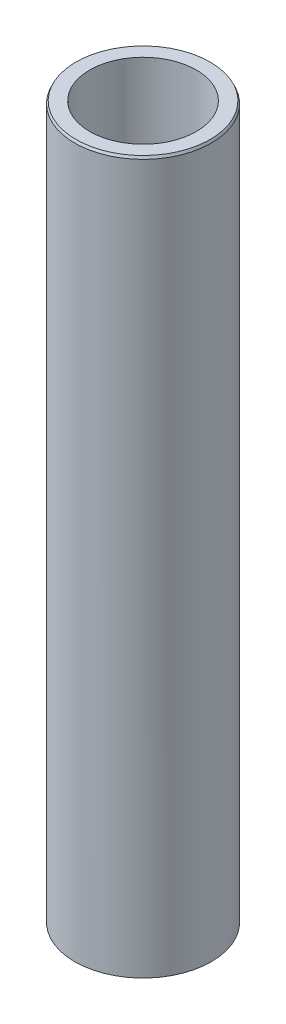
ISO-10303-21;
HEADER;
FILE_DESCRIPTION(('STEP AP214'),'2;1');
FILE_NAME('part.step','',(''),(''),'','','');
FILE_SCHEMA(('AUTOMOTIVE_DESIGN { 1 0 10303 214 1 1 1 1 }'));
ENDSEC;
DATA;
#1=APPLICATION_CONTEXT('core data for automotive mechanical design processes');
#2=APPLICATION_PROTOCOL_DEFINITION('international standard','automotive_design',2000,#1);
#3=PRODUCT_CONTEXT('',#1,'mechanical');
#4=PRODUCT('Part','Part','',(#3));
#5=PRODUCT_RELATED_PRODUCT_CATEGORY('part','',(#4));
#6=PRODUCT_DEFINITION_FORMATION('','',#4);
#7=PRODUCT_DEFINITION_CONTEXT('part definition',#1,'design');
#8=PRODUCT_DEFINITION('design','',#6,#7);
#9=PRODUCT_DEFINITION_SHAPE('','',#8);
#10=(LENGTH_UNIT() NAMED_UNIT(*) SI_UNIT(.MILLI.,.METRE.));
#11=(NAMED_UNIT(*) PLANE_ANGLE_UNIT() SI_UNIT($,.RADIAN.));
#12=(NAMED_UNIT(*) SI_UNIT($,.STERADIAN.) SOLID_ANGLE_UNIT());
#13=UNCERTAINTY_MEASURE_WITH_UNIT(LENGTH_MEASURE(1.E-05),#10,'distance_accuracy_value','');
#14=(GEOMETRIC_REPRESENTATION_CONTEXT(3) GLOBAL_UNCERTAINTY_ASSIGNED_CONTEXT((#13)) GLOBAL_UNIT_ASSIGNED_CONTEXT((#10,
#11,#12)) REPRESENTATION_CONTEXT('',''));
#15=CARTESIAN_POINT('',(0.,0.,0.));
#16=DIRECTION('',(0.,0.,1.));
#17=DIRECTION('',(1.,0.,0.));
#18=AXIS2_PLACEMENT_3D('',#15,#16,#17);
#19=CARTESIAN_POINT('',(0.,600.,0.));
#20=DIRECTION('',(0.,-1.,0.));
#21=DIRECTION('',(0.,0.,-1.));
#22=AXIS2_PLACEMENT_3D('',#19,#20,#21);
#23=CYLINDRICAL_SURFACE('',#22,57.5);
#24=CARTESIAN_POINT('',(0.,597.866919430286,0.));
#25=DIRECTION('',(0.,1.,0.));
#26=DIRECTION('',(0.,0.,1.));
#27=AXIS2_PLACEMENT_3D('',#24,#25,#26);
#28=CIRCLE('',#27,57.5);
#29=CARTESIAN_POINT('',(0.,597.866919430286,-57.5));
#30=VERTEX_POINT('',#29);
#31=EDGE_CURVE('E50',#30,#30,#28,.F.);
#32=ORIENTED_EDGE('',*,*,#31,.T.);
#33=EDGE_LOOP('',(#32));
#34=FACE_BOUND('',#33,.T.);
#35=CARTESIAN_POINT('',(0.,1.0017124247077,0.));
#36=DIRECTION('',(0.,1.,0.));
#37=DIRECTION('',(0.,0.,1.));
#38=AXIS2_PLACEMENT_3D('',#35,#36,#37);
#39=CIRCLE('',#38,57.5);
#40=CARTESIAN_POINT('',(0.,1.0017124247077,57.5));
#41=VERTEX_POINT('',#40);
#42=EDGE_CURVE('E51',#41,#41,#39,.T.);
#43=ORIENTED_EDGE('',*,*,#42,.T.);
#44=EDGE_LOOP('',(#43));
#45=FACE_BOUND('',#44,.T.);
#46=ADVANCED_FACE('F39',(#34,#45),#23,.T.);
#47=CARTESIAN_POINT('',(0.,600.,0.));
#48=DIRECTION('',(0.,1.,0.));
#49=DIRECTION('',(0.,0.,1.));
#50=AXIS2_PLACEMENT_3D('',#47,#48,#49);
#51=PLANE('',#50);
#52=CARTESIAN_POINT('',(0.,600.,0.));
#53=DIRECTION('',(0.,1.,0.));
#54=DIRECTION('',(0.,0.,1.));
#55=AXIS2_PLACEMENT_3D('',#52,#53,#54);
#56=CIRCLE('',#55,56.4982875752921);
#57=CARTESIAN_POINT('',(0.,600.,-56.4982875752921));
#58=VERTEX_POINT('',#57);
#59=EDGE_CURVE('E54',#58,#58,#56,.T.);
#60=ORIENTED_EDGE('',*,*,#59,.T.);
#61=EDGE_LOOP('',(#60));
#62=FACE_BOUND('',#61,.T.);
#63=CARTESIAN_POINT('',(0.,600.,0.));
#64=DIRECTION('',(0.,1.,0.));
#65=DIRECTION('',(0.,0.,1.));
#66=AXIS2_PLACEMENT_3D('',#63,#64,#65);
#67=CIRCLE('',#66,44.8925300068392);
#68=CARTESIAN_POINT('',(0.,600.,44.8925300068392));
#69=VERTEX_POINT('',#68);
#70=EDGE_CURVE('E58',#69,#69,#67,.T.);
#71=ORIENTED_EDGE('',*,*,#70,.F.);
#72=EDGE_LOOP('',(#71));
#73=FACE_BOUND('',#72,.T.);
#74=ADVANCED_FACE('F69',(#62,#73),#51,.T.);
#75=CARTESIAN_POINT('',(0.,0.,0.));
#76=DIRECTION('',(0.,1.,0.));
#77=DIRECTION('',(0.,0.,1.));
#78=AXIS2_PLACEMENT_3D('',#75,#76,#77);
#79=PLANE('',#78);
#80=CARTESIAN_POINT('',(0.,0.,0.));
#81=DIRECTION('',(0.,1.,0.));
#82=DIRECTION('',(0.,0.,1.));
#83=AXIS2_PLACEMENT_3D('',#80,#81,#82);
#84=CIRCLE('',#83,55.3669194302867);
#85=CARTESIAN_POINT('',(0.,0.,55.3669194302867));
#86=VERTEX_POINT('',#85);
#87=EDGE_CURVE('E10',#86,#86,#84,.F.);
#88=ORIENTED_EDGE('',*,*,#87,.T.);
#89=EDGE_LOOP('',(#88));
#90=FACE_BOUND('',#89,.T.);
#91=CARTESIAN_POINT('',(0.,0.,0.));
#92=DIRECTION('',(0.,1.,0.));
#93=DIRECTION('',(0.,0.,1.));
#94=AXIS2_PLACEMENT_3D('',#91,#92,#93);
#95=CIRCLE('',#94,44.8925300068392);
#96=CARTESIAN_POINT('',(0.,0.,44.8925300068392));
#97=VERTEX_POINT('',#96);
#98=EDGE_CURVE('E63',#97,#97,#95,.T.);
#99=ORIENTED_EDGE('',*,*,#98,.T.);
#100=EDGE_LOOP('',(#99));
#101=FACE_BOUND('',#100,.T.);
#102=ADVANCED_FACE('F75',(#90,#101),#79,.F.);
#103=CARTESIAN_POINT('',(0.,600.,0.));
#104=DIRECTION('',(0.,-1.,0.));
#105=DIRECTION('',(0.,0.,-1.));
#106=AXIS2_PLACEMENT_3D('',#103,#104,#105);
#107=CYLINDRICAL_SURFACE('',#106,44.8925300068392);
#108=ORIENTED_EDGE('',*,*,#70,.T.);
#109=EDGE_LOOP('',(#108));
#110=FACE_BOUND('',#109,.T.);
#111=ORIENTED_EDGE('',*,*,#98,.F.);
#112=EDGE_LOOP('',(#111));
#113=FACE_BOUND('',#112,.T.);
#114=ADVANCED_FACE('F70',(#110,#113),#107,.F.);
#115=CARTESIAN_POINT('',(0.,600.,0.));
#116=DIRECTION('',(0.,-1.,0.));
#117=DIRECTION('',(0.,0.,-1.));
#118=AXIS2_PLACEMENT_3D('',#115,#116,#117);
#119=CONICAL_SURFACE('',#118,56.4982875752921,0.439040042509393);
#120=CARTESIAN_POINT('',(0.,597.866919430286,-57.5));
#121=CARTESIAN_POINT('',(0.,597.889139019554,-57.489565495576));
#122=CARTESIAN_POINT('',(0.,597.911358608822,-57.479130991152));
#123=CARTESIAN_POINT('',(0.,597.955797787358,-57.4582619823039));
#124=CARTESIAN_POINT('',(0.,597.978017376626,-57.4478274778798));
#125=CARTESIAN_POINT('',(0.,598.022456555161,-57.4269584690317));
#126=CARTESIAN_POINT('',(0.,598.044676144429,-57.4165239646077));
#127=CARTESIAN_POINT('',(0.,598.089115322965,-57.3956549557596));
#128=CARTESIAN_POINT('',(0.,598.111334912233,-57.3852204513356));
#129=CARTESIAN_POINT('',(0.,598.155774090768,-57.3643514424875));
#130=CARTESIAN_POINT('',(0.,598.177993680036,-57.3539169380634));
#131=CARTESIAN_POINT('',(0.,598.222432858572,-57.3330479292154));
#132=CARTESIAN_POINT('',(0.,598.24465244784,-57.3226134247913));
#133=CARTESIAN_POINT('',(0.,598.289091626375,-57.3017444159432));
#134=CARTESIAN_POINT('',(0.,598.311311215643,-57.2913099115192));
#135=CARTESIAN_POINT('',(0.,598.355750394179,-57.2704409026711));
#136=CARTESIAN_POINT('',(0.,598.377969983447,-57.2600063982471));
#137=CARTESIAN_POINT('',(0.,598.422409161983,-57.239137389399));
#138=CARTESIAN_POINT('',(0.,598.44462875125,-57.228702884975));
#139=CARTESIAN_POINT('',(0.,598.489067929786,-57.2078338761269));
#140=CARTESIAN_POINT('',(0.,598.511287519054,-57.1973993717028));
#141=CARTESIAN_POINT('',(0.,598.55572669759,-57.1765303628547));
#142=CARTESIAN_POINT('',(0.,598.577946286858,-57.1660958584307));
#143=CARTESIAN_POINT('',(0.,598.622385465393,-57.1452268495826));
#144=CARTESIAN_POINT('',(0.,598.644605054661,-57.1347923451586));
#145=CARTESIAN_POINT('',(0.,598.689044233197,-57.1139233363105));
#146=CARTESIAN_POINT('',(0.,598.711263822465,-57.1034888318865));
#147=CARTESIAN_POINT('',(0.,598.755703001,-57.0826198230384));
#148=CARTESIAN_POINT('',(0.,598.777922590268,-57.0721853186143));
#149=CARTESIAN_POINT('',(0.,598.822361768804,-57.0513163097663));
#150=CARTESIAN_POINT('',(0.,598.844581358072,-57.0408818053422));
#151=CARTESIAN_POINT('',(0.,598.889020536607,-57.0200127964941));
#152=CARTESIAN_POINT('',(0.,598.911240125875,-57.0095782920701));
#153=CARTESIAN_POINT('',(0.,598.955679304411,-56.988709283222));
#154=CARTESIAN_POINT('',(0.,598.977898893679,-56.978274778798));
#155=CARTESIAN_POINT('',(0.,599.022338072215,-56.9574057699499));
#156=CARTESIAN_POINT('',(0.,599.044557661482,-56.9469712655259));
#157=CARTESIAN_POINT('',(0.,599.088996840018,-56.9261022566778));
#158=CARTESIAN_POINT('',(0.,599.111216429286,-56.9156677522537));
#159=CARTESIAN_POINT('',(0.,599.155655607822,-56.8947987434057));
#160=CARTESIAN_POINT('',(0.,599.177875197089,-56.8843642389816));
#161=CARTESIAN_POINT('',(0.,599.222314375625,-56.8634952301335));
#162=CARTESIAN_POINT('',(0.,599.244533964893,-56.8530607257095));
#163=CARTESIAN_POINT('',(0.,599.288973143429,-56.8321917168614));
#164=CARTESIAN_POINT('',(0.,599.311192732697,-56.8217572124374));
#165=CARTESIAN_POINT('',(0.,599.355631911232,-56.8008882035893));
#166=CARTESIAN_POINT('',(0.,599.3778515005,-56.7904536991652));
#167=CARTESIAN_POINT('',(0.,599.422290679036,-56.7695846903172));
#168=CARTESIAN_POINT('',(0.,599.444510268304,-56.7591501858931));
#169=CARTESIAN_POINT('',(0.,599.488949446839,-56.738281177045));
#170=CARTESIAN_POINT('',(0.,599.511169036107,-56.727846672621));
#171=CARTESIAN_POINT('',(0.,599.555608214643,-56.7069776637729));
#172=CARTESIAN_POINT('',(0.,599.577827803911,-56.6965431593489));
#173=CARTESIAN_POINT('',(0.,599.622266982446,-56.6756741505008));
#174=CARTESIAN_POINT('',(0.,599.644486571714,-56.6652396460767));
#175=CARTESIAN_POINT('',(0.,599.68892575025,-56.6443706372287));
#176=CARTESIAN_POINT('',(0.,599.711145339518,-56.6339361328046));
#177=CARTESIAN_POINT('',(0.,599.755584518054,-56.6130671239565));
#178=CARTESIAN_POINT('',(0.,599.777804107321,-56.6026326195325));
#179=CARTESIAN_POINT('',(0.,599.822243285857,-56.5817636106844));
#180=CARTESIAN_POINT('',(0.,599.844462875125,-56.5713291062604));
#181=CARTESIAN_POINT('',(0.,599.888902053661,-56.5504600974123));
#182=CARTESIAN_POINT('',(0.,599.911121642928,-56.5400255929883));
#183=CARTESIAN_POINT('',(0.,599.955560821464,-56.5191565841402));
#184=CARTESIAN_POINT('',(0.,599.977780410732,-56.5087220797161));
#185=CARTESIAN_POINT('',(0.,600.,-56.4982875752921));
#186=B_SPLINE_CURVE_WITH_KNOTS('',3,(#120,#121,#122,#123,#124,#125,#126,#127,#128,#129,#130,
#131,#132,#133,#134,#135,#136,#137,#138,#139,#140,#141,#142,#143,#144,#145,#146,#147,#148,#149,
#150,#151,#152,#153,#154,#155,#156,#157,#158,#159,#160,#161,#162,#163,#164,#165,#166,#167,#168,
#169,#170,#171,#172,#173,#174,#175,#176,#177,#178,#179,#180,#181,#182,#183,#184,#185),
.UNSPECIFIED.,.F.,.F.,(4,2,2,2,2,2,2,2,2,2,2,2,2,2,2,2,2,2,2,2,2,2,2,2,2,2,2,2,2,2,2,2,4),(0.,
0.0736430666680784,0.147286133336056,0.220929200004034,0.294572266672012,0.368215333339993,
0.441858400007971,0.515501466675949,0.589144533343927,0.662787600011905,0.736430666679883,
0.810073733347961,0.883716800015939,0.957359866683917,1.0310029333519,1.10464600001987,
1.17828906668785,1.25193213335583,1.32557520002381,1.39921826669178,1.47286133335976,
1.54650440002774,1.62014746669582,1.6937905333638,1.76743360003178,1.84107666669976,
1.91471973336773,1.98836280003571,2.06200586670369,2.13564893337167,2.20929200003965,
2.28293506670762,2.3565781333757),.UNSPECIFIED.);
#187=EDGE_CURVE('BSEAM81',#30,#58,#186,.T.);
#188=ORIENTED_EDGE('',*,*,#31,.F.);
#189=ORIENTED_EDGE('',*,*,#59,.F.);
#190=ORIENTED_EDGE('',*,*,#187,.T.);
#191=ORIENTED_EDGE('',*,*,#187,.F.);
#192=EDGE_LOOP('',(#188,#190,#189,#191));
#193=FACE_BOUND('',#192,.T.);
#194=ADVANCED_FACE('F81',(#193),#119,.T.);
#195=CARTESIAN_POINT('',(0.,1.0017124247077,0.));
#196=DIRECTION('',(0.,1.,0.));
#197=DIRECTION('',(0.,0.,1.));
#198=AXIS2_PLACEMENT_3D('',#195,#196,#197);
#199=CONICAL_SURFACE('',#198,57.5,1.13175628428553);
#200=ORIENTED_EDGE('',*,*,#87,.F.);
#201=EDGE_LOOP('',(#200));
#202=FACE_BOUND('',#201,.T.);
#203=ORIENTED_EDGE('',*,*,#42,.F.);
#204=EDGE_LOOP('',(#203));
#205=FACE_BOUND('',#204,.T.);
#206=ADVANCED_FACE('F45',(#202,#205),#199,.T.);
#207=CLOSED_SHELL('',(#46,#74,#102,#114,#194,#206));
#208=MANIFOLD_SOLID_BREP('B2',#207);
#209=ADVANCED_BREP_SHAPE_REPRESENTATION('',(#18,#208),#14);
#210=SHAPE_DEFINITION_REPRESENTATION(#9,#209);
ENDSEC;
END-ISO-10303-21;
